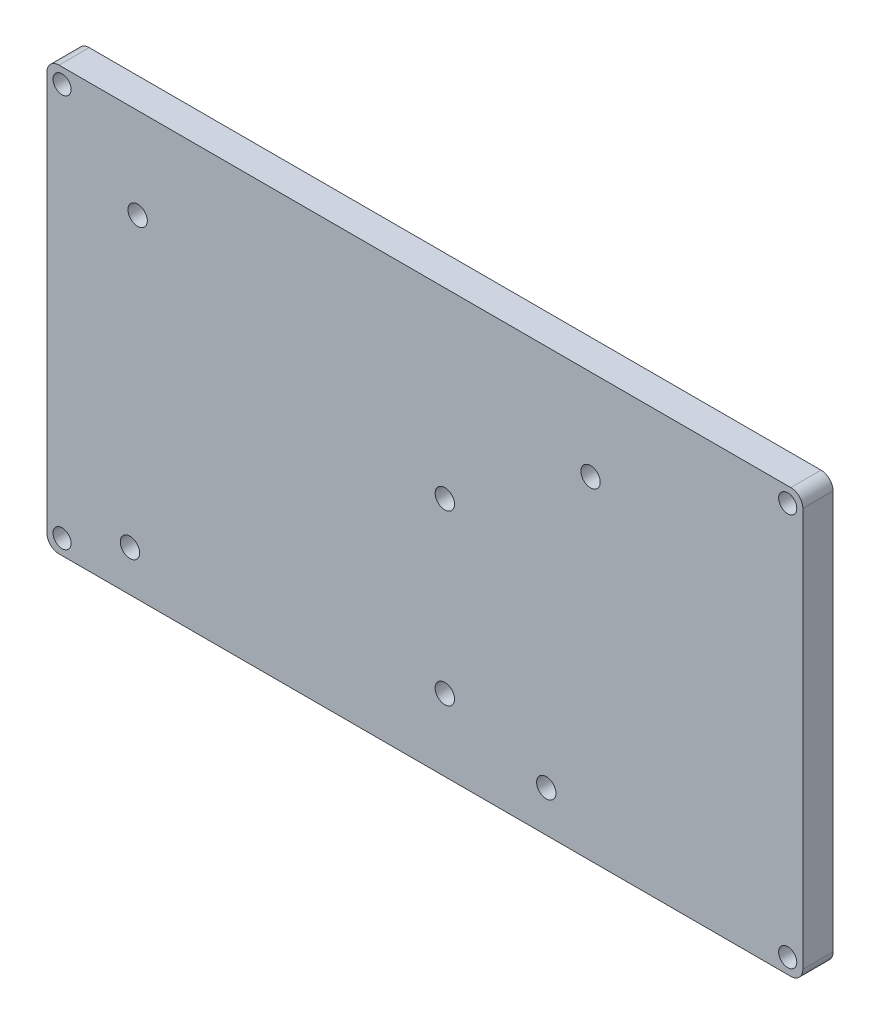
ISO-10303-21;
HEADER;
FILE_DESCRIPTION(('STEP AP214'),'2;1');
FILE_NAME('part.step','',(''),(''),'','','');
FILE_SCHEMA(('AUTOMOTIVE_DESIGN { 1 0 10303 214 1 1 1 1 }'));
ENDSEC;
DATA;
#1=APPLICATION_CONTEXT('core data for automotive mechanical design processes');
#2=APPLICATION_PROTOCOL_DEFINITION('international standard','automotive_design',2000,#1);
#3=PRODUCT_CONTEXT('',#1,'mechanical');
#4=PRODUCT('Part','Part','',(#3));
#5=PRODUCT_RELATED_PRODUCT_CATEGORY('part','',(#4));
#6=PRODUCT_DEFINITION_FORMATION('','',#4);
#7=PRODUCT_DEFINITION_CONTEXT('part definition',#1,'design');
#8=PRODUCT_DEFINITION('design','',#6,#7);
#9=PRODUCT_DEFINITION_SHAPE('','',#8);
#10=(LENGTH_UNIT() NAMED_UNIT(*) SI_UNIT(.MILLI.,.METRE.));
#11=(NAMED_UNIT(*) PLANE_ANGLE_UNIT() SI_UNIT($,.RADIAN.));
#12=(NAMED_UNIT(*) SI_UNIT($,.STERADIAN.) SOLID_ANGLE_UNIT());
#13=UNCERTAINTY_MEASURE_WITH_UNIT(LENGTH_MEASURE(1.E-05),#10,'distance_accuracy_value','');
#14=(GEOMETRIC_REPRESENTATION_CONTEXT(3) GLOBAL_UNCERTAINTY_ASSIGNED_CONTEXT((#13)) GLOBAL_UNIT_ASSIGNED_CONTEXT((#10,
#11,#12)) REPRESENTATION_CONTEXT('',''));
#15=CARTESIAN_POINT('',(0.,0.,0.));
#16=DIRECTION('',(0.,0.,1.));
#17=DIRECTION('',(1.,0.,0.));
#18=AXIS2_PLACEMENT_3D('',#15,#16,#17);
#19=CARTESIAN_POINT('',(0.,0.,5.));
#20=DIRECTION('',(0.,0.,-1.));
#21=DIRECTION('',(-1.,0.,0.));
#22=AXIS2_PLACEMENT_3D('',#19,#20,#21);
#23=PLANE('',#22);
#24=DIRECTION('',(0.,-1.,0.));
#25=VECTOR('',#24,1.);
#26=CARTESIAN_POINT('',(0.,0.,5.));
#27=LINE('',#26,#25);
#28=CARTESIAN_POINT('',(0.,68.,5.));
#29=VERTEX_POINT('',#28);
#30=CARTESIAN_POINT('',(0.,2.,5.));
#31=VERTEX_POINT('',#30);
#32=EDGE_CURVE('E151',#29,#31,#27,.T.);
#33=ORIENTED_EDGE('',*,*,#32,.T.);
#34=CARTESIAN_POINT('',(2.,2.,5.));
#35=DIRECTION('',(0.,0.,-1.));
#36=DIRECTION('',(-1.,0.,0.));
#37=AXIS2_PLACEMENT_3D('',#34,#35,#36);
#38=CIRCLE('',#37,2.);
#39=CARTESIAN_POINT('',(2.,0.,5.));
#40=VERTEX_POINT('',#39);
#41=EDGE_CURVE('E175',#31,#40,#38,.F.);
#42=ORIENTED_EDGE('',*,*,#41,.T.);
#43=DIRECTION('',(1.,0.,0.));
#44=VECTOR('',#43,1.);
#45=CARTESIAN_POINT('',(0.,0.,5.));
#46=LINE('',#45,#44);
#47=CARTESIAN_POINT('',(123.,0.,5.));
#48=VERTEX_POINT('',#47);
#49=EDGE_CURVE('E128',#40,#48,#46,.T.);
#50=ORIENTED_EDGE('',*,*,#49,.T.);
#51=CARTESIAN_POINT('',(123.,2.,5.));
#52=DIRECTION('',(0.,0.,-1.));
#53=DIRECTION('',(-1.,0.,0.));
#54=AXIS2_PLACEMENT_3D('',#51,#52,#53);
#55=CIRCLE('',#54,2.);
#56=CARTESIAN_POINT('',(125.,2.,5.));
#57=VERTEX_POINT('',#56);
#58=EDGE_CURVE('E167',#48,#57,#55,.F.);
#59=ORIENTED_EDGE('',*,*,#58,.T.);
#60=DIRECTION('',(0.,1.,0.));
#61=VECTOR('',#60,1.);
#62=CARTESIAN_POINT('',(125.,0.,5.));
#63=LINE('',#62,#61);
#64=CARTESIAN_POINT('',(125.,68.,5.));
#65=VERTEX_POINT('',#64);
#66=EDGE_CURVE('E190',#57,#65,#63,.T.);
#67=ORIENTED_EDGE('',*,*,#66,.T.);
#68=CARTESIAN_POINT('',(123.,68.,5.));
#69=DIRECTION('',(0.,0.,-1.));
#70=DIRECTION('',(-1.,0.,0.));
#71=AXIS2_PLACEMENT_3D('',#68,#69,#70);
#72=CIRCLE('',#71,2.);
#73=CARTESIAN_POINT('',(123.,70.,5.));
#74=VERTEX_POINT('',#73);
#75=EDGE_CURVE('E63',#65,#74,#72,.F.);
#76=ORIENTED_EDGE('',*,*,#75,.T.);
#77=DIRECTION('',(-1.,0.,0.));
#78=VECTOR('',#77,1.);
#79=CARTESIAN_POINT('',(0.,70.,5.));
#80=LINE('',#79,#78);
#81=CARTESIAN_POINT('',(2.,70.,5.));
#82=VERTEX_POINT('',#81);
#83=EDGE_CURVE('E153',#74,#82,#80,.T.);
#84=ORIENTED_EDGE('',*,*,#83,.T.);
#85=CARTESIAN_POINT('',(2.,68.,5.));
#86=DIRECTION('',(0.,0.,-1.));
#87=DIRECTION('',(-1.,0.,0.));
#88=AXIS2_PLACEMENT_3D('',#85,#86,#87);
#89=CIRCLE('',#88,2.);
#90=EDGE_CURVE('E172',#82,#29,#89,.F.);
#91=ORIENTED_EDGE('',*,*,#90,.T.);
#92=EDGE_LOOP('',(#33,#42,#50,#59,#67,#76,#84,#91));
#93=FACE_BOUND('',#92,.T.);
#94=CARTESIAN_POINT('',(15.,55.,5.));
#95=DIRECTION('',(0.,0.,1.));
#96=DIRECTION('',(1.,0.,0.));
#97=AXIS2_PLACEMENT_3D('',#94,#95,#96);
#98=CIRCLE('',#97,1.6);
#99=CARTESIAN_POINT('',(16.6,55.,5.));
#100=VERTEX_POINT('',#99);
#101=EDGE_CURVE('E145',#100,#100,#98,.T.);
#102=ORIENTED_EDGE('',*,*,#101,.F.);
#103=EDGE_LOOP('',(#102));
#104=FACE_BOUND('',#103,.T.);
#105=CARTESIAN_POINT('',(13.73,6.80000000000001,5.));
#106=DIRECTION('',(0.,0.,1.));
#107=DIRECTION('',(1.,0.,0.));
#108=AXIS2_PLACEMENT_3D('',#105,#106,#107);
#109=CIRCLE('',#108,1.6);
#110=CARTESIAN_POINT('',(15.33,6.80000000000001,5.));
#111=VERTEX_POINT('',#110);
#112=EDGE_CURVE('E212',#111,#111,#109,.T.);
#113=ORIENTED_EDGE('',*,*,#112,.F.);
#114=EDGE_LOOP('',(#113));
#115=FACE_BOUND('',#114,.T.);
#116=CARTESIAN_POINT('',(82.5735337569586,6.80000000000001,5.));
#117=DIRECTION('',(0.,0.,1.));
#118=DIRECTION('',(1.,0.,0.));
#119=AXIS2_PLACEMENT_3D('',#116,#117,#118);
#120=CIRCLE('',#119,1.60000000000001);
#121=CARTESIAN_POINT('',(84.1735337569586,6.80000000000001,5.));
#122=VERTEX_POINT('',#121);
#123=EDGE_CURVE('E220',#122,#122,#120,.T.);
#124=ORIENTED_EDGE('',*,*,#123,.F.);
#125=EDGE_LOOP('',(#124));
#126=FACE_BOUND('',#125,.T.);
#127=CARTESIAN_POINT('',(89.9,55.,5.));
#128=DIRECTION('',(0.,0.,1.));
#129=DIRECTION('',(1.,0.,0.));
#130=AXIS2_PLACEMENT_3D('',#127,#128,#129);
#131=CIRCLE('',#130,1.60000000000001);
#132=CARTESIAN_POINT('',(91.5,55.,5.));
#133=VERTEX_POINT('',#132);
#134=EDGE_CURVE('E228',#133,#133,#131,.T.);
#135=ORIENTED_EDGE('',*,*,#134,.F.);
#136=EDGE_LOOP('',(#135));
#137=FACE_BOUND('',#136,.T.);
#138=CARTESIAN_POINT('',(65.8,39.8,5.));
#139=DIRECTION('',(0.,0.,1.));
#140=DIRECTION('',(1.,0.,0.));
#141=AXIS2_PLACEMENT_3D('',#138,#139,#140);
#142=CIRCLE('',#141,1.60000000000001);
#143=CARTESIAN_POINT('',(67.4,39.8,5.));
#144=VERTEX_POINT('',#143);
#145=EDGE_CURVE('E236',#144,#144,#142,.T.);
#146=ORIENTED_EDGE('',*,*,#145,.F.);
#147=EDGE_LOOP('',(#146));
#148=FACE_BOUND('',#147,.T.);
#149=CARTESIAN_POINT('',(65.8,11.9,5.));
#150=DIRECTION('',(0.,0.,1.));
#151=DIRECTION('',(1.,0.,0.));
#152=AXIS2_PLACEMENT_3D('',#149,#150,#151);
#153=CIRCLE('',#152,1.6);
#154=CARTESIAN_POINT('',(67.4,11.9,5.));
#155=VERTEX_POINT('',#154);
#156=EDGE_CURVE('E244',#155,#155,#153,.T.);
#157=ORIENTED_EDGE('',*,*,#156,.F.);
#158=EDGE_LOOP('',(#157));
#159=FACE_BOUND('',#158,.T.);
#160=CARTESIAN_POINT('',(2.5,67.5,5.));
#161=DIRECTION('',(0.,0.,1.));
#162=DIRECTION('',(1.,0.,0.));
#163=AXIS2_PLACEMENT_3D('',#160,#161,#162);
#164=CIRCLE('',#163,1.5);
#165=CARTESIAN_POINT('',(4.,67.5,5.));
#166=VERTEX_POINT('',#165);
#167=EDGE_CURVE('E252',#166,#166,#164,.T.);
#168=ORIENTED_EDGE('',*,*,#167,.F.);
#169=EDGE_LOOP('',(#168));
#170=FACE_BOUND('',#169,.T.);
#171=CARTESIAN_POINT('',(122.5,2.5,5.));
#172=DIRECTION('',(0.,0.,1.));
#173=DIRECTION('',(-1.,0.,0.));
#174=AXIS2_PLACEMENT_3D('',#171,#172,#173);
#175=CIRCLE('',#174,1.5);
#176=CARTESIAN_POINT('',(121.,2.5,5.));
#177=VERTEX_POINT('',#176);
#178=EDGE_CURVE('E260',#177,#177,#175,.T.);
#179=ORIENTED_EDGE('',*,*,#178,.F.);
#180=EDGE_LOOP('',(#179));
#181=FACE_BOUND('',#180,.T.);
#182=CARTESIAN_POINT('',(122.5,67.5,5.));
#183=DIRECTION('',(0.,0.,1.));
#184=DIRECTION('',(1.,0.,0.));
#185=AXIS2_PLACEMENT_3D('',#182,#183,#184);
#186=CIRCLE('',#185,1.5);
#187=CARTESIAN_POINT('',(124.,67.5,5.));
#188=VERTEX_POINT('',#187);
#189=EDGE_CURVE('E268',#188,#188,#186,.T.);
#190=ORIENTED_EDGE('',*,*,#189,.F.);
#191=EDGE_LOOP('',(#190));
#192=FACE_BOUND('',#191,.T.);
#193=CARTESIAN_POINT('',(2.5,2.5,5.));
#194=DIRECTION('',(0.,0.,1.));
#195=DIRECTION('',(-1.,0.,0.));
#196=AXIS2_PLACEMENT_3D('',#193,#194,#195);
#197=CIRCLE('',#196,1.5);
#198=CARTESIAN_POINT('',(1.,2.5,5.));
#199=VERTEX_POINT('',#198);
#200=EDGE_CURVE('E276',#199,#199,#197,.T.);
#201=ORIENTED_EDGE('',*,*,#200,.F.);
#202=EDGE_LOOP('',(#201));
#203=FACE_BOUND('',#202,.T.);
#204=ADVANCED_FACE('F40',(#93,#104,#115,#126,#137,#148,#159,#170,#181,#192,#203),#23,.F.);
#205=CARTESIAN_POINT('',(0.,0.,0.));
#206=DIRECTION('',(0.,0.,-1.));
#207=DIRECTION('',(-1.,0.,0.));
#208=AXIS2_PLACEMENT_3D('',#205,#206,#207);
#209=PLANE('',#208);
#210=CARTESIAN_POINT('',(122.5,67.5,0.));
#211=DIRECTION('',(0.,0.,1.));
#212=DIRECTION('',(1.,0.,0.));
#213=AXIS2_PLACEMENT_3D('',#210,#211,#212);
#214=CIRCLE('',#213,1.5);
#215=CARTESIAN_POINT('',(124.,67.5,0.));
#216=VERTEX_POINT('',#215);
#217=EDGE_CURVE('E272',#216,#216,#214,.T.);
#218=ORIENTED_EDGE('',*,*,#217,.T.);
#219=EDGE_LOOP('',(#218));
#220=FACE_BOUND('',#219,.T.);
#221=CARTESIAN_POINT('',(2.5,67.5,0.));
#222=DIRECTION('',(0.,0.,1.));
#223=DIRECTION('',(1.,0.,0.));
#224=AXIS2_PLACEMENT_3D('',#221,#222,#223);
#225=CIRCLE('',#224,1.5);
#226=CARTESIAN_POINT('',(4.,67.5,0.));
#227=VERTEX_POINT('',#226);
#228=EDGE_CURVE('E256',#227,#227,#225,.T.);
#229=ORIENTED_EDGE('',*,*,#228,.T.);
#230=EDGE_LOOP('',(#229));
#231=FACE_BOUND('',#230,.T.);
#232=CARTESIAN_POINT('',(65.8,39.8,0.));
#233=DIRECTION('',(0.,0.,1.));
#234=DIRECTION('',(1.,0.,0.));
#235=AXIS2_PLACEMENT_3D('',#232,#233,#234);
#236=CIRCLE('',#235,1.60000000000001);
#237=CARTESIAN_POINT('',(67.4,39.8,0.));
#238=VERTEX_POINT('',#237);
#239=EDGE_CURVE('E240',#238,#238,#236,.T.);
#240=ORIENTED_EDGE('',*,*,#239,.T.);
#241=EDGE_LOOP('',(#240));
#242=FACE_BOUND('',#241,.T.);
#243=CARTESIAN_POINT('',(82.5735337569586,6.80000000000001,0.));
#244=DIRECTION('',(0.,0.,1.));
#245=DIRECTION('',(1.,0.,0.));
#246=AXIS2_PLACEMENT_3D('',#243,#244,#245);
#247=CIRCLE('',#246,1.60000000000001);
#248=CARTESIAN_POINT('',(84.1735337569586,6.80000000000001,0.));
#249=VERTEX_POINT('',#248);
#250=EDGE_CURVE('E224',#249,#249,#247,.T.);
#251=ORIENTED_EDGE('',*,*,#250,.T.);
#252=EDGE_LOOP('',(#251));
#253=FACE_BOUND('',#252,.T.);
#254=CARTESIAN_POINT('',(15.,55.,0.));
#255=DIRECTION('',(0.,0.,1.));
#256=DIRECTION('',(1.,0.,0.));
#257=AXIS2_PLACEMENT_3D('',#254,#255,#256);
#258=CIRCLE('',#257,1.6);
#259=CARTESIAN_POINT('',(16.6,55.,0.));
#260=VERTEX_POINT('',#259);
#261=EDGE_CURVE('E208',#260,#260,#258,.T.);
#262=ORIENTED_EDGE('',*,*,#261,.T.);
#263=EDGE_LOOP('',(#262));
#264=FACE_BOUND('',#263,.T.);
#265=DIRECTION('',(1.,0.,0.));
#266=VECTOR('',#265,1.);
#267=CARTESIAN_POINT('',(0.,0.,0.));
#268=LINE('',#267,#266);
#269=CARTESIAN_POINT('',(2.,0.,0.));
#270=VERTEX_POINT('',#269);
#271=CARTESIAN_POINT('',(123.,0.,0.));
#272=VERTEX_POINT('',#271);
#273=EDGE_CURVE('E125',#270,#272,#268,.T.);
#274=ORIENTED_EDGE('',*,*,#273,.F.);
#275=CARTESIAN_POINT('',(2.,2.,0.));
#276=DIRECTION('',(0.,0.,-1.));
#277=DIRECTION('',(-1.,0.,0.));
#278=AXIS2_PLACEMENT_3D('',#275,#276,#277);
#279=CIRCLE('',#278,2.);
#280=CARTESIAN_POINT('',(0.,2.,0.));
#281=VERTEX_POINT('',#280);
#282=EDGE_CURVE('E107',#270,#281,#279,.T.);
#283=ORIENTED_EDGE('',*,*,#282,.T.);
#284=DIRECTION('',(0.,-1.,0.));
#285=VECTOR('',#284,1.);
#286=CARTESIAN_POINT('',(0.,0.,0.));
#287=LINE('',#286,#285);
#288=CARTESIAN_POINT('',(0.,68.,0.));
#289=VERTEX_POINT('',#288);
#290=EDGE_CURVE('E138',#289,#281,#287,.T.);
#291=ORIENTED_EDGE('',*,*,#290,.F.);
#292=CARTESIAN_POINT('',(2.,68.,0.));
#293=DIRECTION('',(0.,0.,-1.));
#294=DIRECTION('',(-1.,0.,0.));
#295=AXIS2_PLACEMENT_3D('',#292,#293,#294);
#296=CIRCLE('',#295,2.);
#297=CARTESIAN_POINT('',(2.,70.,0.));
#298=VERTEX_POINT('',#297);
#299=EDGE_CURVE('E119',#289,#298,#296,.T.);
#300=ORIENTED_EDGE('',*,*,#299,.T.);
#301=DIRECTION('',(-1.,0.,0.));
#302=VECTOR('',#301,1.);
#303=CARTESIAN_POINT('',(0.,70.,0.));
#304=LINE('',#303,#302);
#305=CARTESIAN_POINT('',(123.,70.,0.));
#306=VERTEX_POINT('',#305);
#307=EDGE_CURVE('E143',#306,#298,#304,.T.);
#308=ORIENTED_EDGE('',*,*,#307,.F.);
#309=CARTESIAN_POINT('',(123.,68.,0.));
#310=DIRECTION('',(0.,0.,-1.));
#311=DIRECTION('',(-1.,0.,0.));
#312=AXIS2_PLACEMENT_3D('',#309,#310,#311);
#313=CIRCLE('',#312,2.);
#314=CARTESIAN_POINT('',(125.,68.,0.));
#315=VERTEX_POINT('',#314);
#316=EDGE_CURVE('E157',#306,#315,#313,.T.);
#317=ORIENTED_EDGE('',*,*,#316,.T.);
#318=DIRECTION('',(0.,1.,0.));
#319=VECTOR('',#318,1.);
#320=CARTESIAN_POINT('',(125.,0.,0.));
#321=LINE('',#320,#319);
#322=CARTESIAN_POINT('',(125.,2.,0.));
#323=VERTEX_POINT('',#322);
#324=EDGE_CURVE('E137',#323,#315,#321,.T.);
#325=ORIENTED_EDGE('',*,*,#324,.F.);
#326=CARTESIAN_POINT('',(123.,2.,0.));
#327=DIRECTION('',(0.,0.,-1.));
#328=DIRECTION('',(-1.,0.,0.));
#329=AXIS2_PLACEMENT_3D('',#326,#327,#328);
#330=CIRCLE('',#329,2.);
#331=EDGE_CURVE('E130',#323,#272,#330,.T.);
#332=ORIENTED_EDGE('',*,*,#331,.T.);
#333=EDGE_LOOP('',(#274,#283,#291,#300,#308,#317,#325,#332));
#334=FACE_BOUND('',#333,.T.);
#335=CARTESIAN_POINT('',(13.73,6.80000000000001,0.));
#336=DIRECTION('',(0.,0.,1.));
#337=DIRECTION('',(1.,0.,0.));
#338=AXIS2_PLACEMENT_3D('',#335,#336,#337);
#339=CIRCLE('',#338,1.6);
#340=CARTESIAN_POINT('',(15.33,6.80000000000001,0.));
#341=VERTEX_POINT('',#340);
#342=EDGE_CURVE('E216',#341,#341,#339,.T.);
#343=ORIENTED_EDGE('',*,*,#342,.T.);
#344=EDGE_LOOP('',(#343));
#345=FACE_BOUND('',#344,.T.);
#346=CARTESIAN_POINT('',(89.9,55.,0.));
#347=DIRECTION('',(0.,0.,1.));
#348=DIRECTION('',(1.,0.,0.));
#349=AXIS2_PLACEMENT_3D('',#346,#347,#348);
#350=CIRCLE('',#349,1.60000000000001);
#351=CARTESIAN_POINT('',(91.5,55.,0.));
#352=VERTEX_POINT('',#351);
#353=EDGE_CURVE('E232',#352,#352,#350,.T.);
#354=ORIENTED_EDGE('',*,*,#353,.T.);
#355=EDGE_LOOP('',(#354));
#356=FACE_BOUND('',#355,.T.);
#357=CARTESIAN_POINT('',(65.8,11.9,0.));
#358=DIRECTION('',(0.,0.,1.));
#359=DIRECTION('',(1.,0.,0.));
#360=AXIS2_PLACEMENT_3D('',#357,#358,#359);
#361=CIRCLE('',#360,1.6);
#362=CARTESIAN_POINT('',(67.4,11.9,0.));
#363=VERTEX_POINT('',#362);
#364=EDGE_CURVE('E248',#363,#363,#361,.T.);
#365=ORIENTED_EDGE('',*,*,#364,.T.);
#366=EDGE_LOOP('',(#365));
#367=FACE_BOUND('',#366,.T.);
#368=CARTESIAN_POINT('',(122.5,2.5,0.));
#369=DIRECTION('',(0.,0.,1.));
#370=DIRECTION('',(-1.,0.,0.));
#371=AXIS2_PLACEMENT_3D('',#368,#369,#370);
#372=CIRCLE('',#371,1.5);
#373=CARTESIAN_POINT('',(121.,2.5,0.));
#374=VERTEX_POINT('',#373);
#375=EDGE_CURVE('E264',#374,#374,#372,.T.);
#376=ORIENTED_EDGE('',*,*,#375,.T.);
#377=EDGE_LOOP('',(#376));
#378=FACE_BOUND('',#377,.T.);
#379=CARTESIAN_POINT('',(2.5,2.5,0.));
#380=DIRECTION('',(0.,0.,1.));
#381=DIRECTION('',(-1.,0.,0.));
#382=AXIS2_PLACEMENT_3D('',#379,#380,#381);
#383=CIRCLE('',#382,1.5);
#384=CARTESIAN_POINT('',(1.,2.5,0.));
#385=VERTEX_POINT('',#384);
#386=EDGE_CURVE('E280',#385,#385,#383,.T.);
#387=ORIENTED_EDGE('',*,*,#386,.T.);
#388=EDGE_LOOP('',(#387));
#389=FACE_BOUND('',#388,.T.);
#390=ADVANCED_FACE('F133',(#220,#231,#242,#253,#264,#334,#345,#356,#367,#378,#389),#209,.T.);
#391=CARTESIAN_POINT('',(0.,0.,5.));
#392=DIRECTION('',(1.,0.,0.));
#393=DIRECTION('',(0.,0.,-1.));
#394=AXIS2_PLACEMENT_3D('',#391,#392,#393);
#395=PLANE('',#394);
#396=ORIENTED_EDGE('',*,*,#290,.T.);
#397=DIRECTION('',(0.,0.,-1.));
#398=VECTOR('',#397,1.);
#399=CARTESIAN_POINT('',(0.,2.,5.));
#400=LINE('',#399,#398);
#401=EDGE_CURVE('E112',#281,#31,#400,.F.);
#402=ORIENTED_EDGE('',*,*,#401,.T.);
#403=ORIENTED_EDGE('',*,*,#32,.F.);
#404=DIRECTION('',(0.,0.,-1.));
#405=VECTOR('',#404,1.);
#406=CARTESIAN_POINT('',(0.,68.,5.));
#407=LINE('',#406,#405);
#408=EDGE_CURVE('E118',#29,#289,#407,.T.);
#409=ORIENTED_EDGE('',*,*,#408,.T.);
#410=EDGE_LOOP('',(#396,#402,#403,#409));
#411=FACE_BOUND('',#410,.T.);
#412=ADVANCED_FACE('F295',(#411),#395,.F.);
#413=CARTESIAN_POINT('',(0.,0.,5.));
#414=DIRECTION('',(0.,1.,0.));
#415=DIRECTION('',(0.,0.,1.));
#416=AXIS2_PLACEMENT_3D('',#413,#414,#415);
#417=PLANE('',#416);
#418=ORIENTED_EDGE('',*,*,#49,.F.);
#419=DIRECTION('',(0.,0.,-1.));
#420=VECTOR('',#419,1.);
#421=CARTESIAN_POINT('',(2.,0.,5.));
#422=LINE('',#421,#420);
#423=EDGE_CURVE('E111',#40,#270,#422,.T.);
#424=ORIENTED_EDGE('',*,*,#423,.T.);
#425=ORIENTED_EDGE('',*,*,#273,.T.);
#426=DIRECTION('',(0.,0.,-1.));
#427=VECTOR('',#426,1.);
#428=CARTESIAN_POINT('',(123.,0.,5.));
#429=LINE('',#428,#427);
#430=EDGE_CURVE('E131',#272,#48,#429,.F.);
#431=ORIENTED_EDGE('',*,*,#430,.T.);
#432=EDGE_LOOP('',(#418,#424,#425,#431));
#433=FACE_BOUND('',#432,.T.);
#434=ADVANCED_FACE('F124',(#433),#417,.F.);
#435=CARTESIAN_POINT('',(125.,0.,5.));
#436=DIRECTION('',(-1.,0.,0.));
#437=DIRECTION('',(0.,0.,1.));
#438=AXIS2_PLACEMENT_3D('',#435,#436,#437);
#439=PLANE('',#438);
#440=ORIENTED_EDGE('',*,*,#324,.T.);
#441=DIRECTION('',(0.,0.,-1.));
#442=VECTOR('',#441,1.);
#443=CARTESIAN_POINT('',(125.,68.,5.));
#444=LINE('',#443,#442);
#445=EDGE_CURVE('E11',#315,#65,#444,.F.);
#446=ORIENTED_EDGE('',*,*,#445,.T.);
#447=ORIENTED_EDGE('',*,*,#66,.F.);
#448=DIRECTION('',(0.,0.,-1.));
#449=VECTOR('',#448,1.);
#450=CARTESIAN_POINT('',(125.,2.,5.));
#451=LINE('',#450,#449);
#452=EDGE_CURVE('E49',#57,#323,#451,.T.);
#453=ORIENTED_EDGE('',*,*,#452,.T.);
#454=EDGE_LOOP('',(#440,#446,#447,#453));
#455=FACE_BOUND('',#454,.T.);
#456=ADVANCED_FACE('F188',(#455),#439,.F.);
#457=CARTESIAN_POINT('',(0.,70.,5.));
#458=DIRECTION('',(0.,-1.,0.));
#459=DIRECTION('',(0.,0.,-1.));
#460=AXIS2_PLACEMENT_3D('',#457,#458,#459);
#461=PLANE('',#460);
#462=ORIENTED_EDGE('',*,*,#307,.T.);
#463=DIRECTION('',(0.,0.,-1.));
#464=VECTOR('',#463,1.);
#465=CARTESIAN_POINT('',(2.,70.,5.));
#466=LINE('',#465,#464);
#467=EDGE_CURVE('E56',#298,#82,#466,.F.);
#468=ORIENTED_EDGE('',*,*,#467,.T.);
#469=ORIENTED_EDGE('',*,*,#83,.F.);
#470=DIRECTION('',(0.,0.,-1.));
#471=VECTOR('',#470,1.);
#472=CARTESIAN_POINT('',(123.,70.,5.));
#473=LINE('',#472,#471);
#474=EDGE_CURVE('E178',#74,#306,#473,.T.);
#475=ORIENTED_EDGE('',*,*,#474,.T.);
#476=EDGE_LOOP('',(#462,#468,#469,#475));
#477=FACE_BOUND('',#476,.T.);
#478=ADVANCED_FACE('F197',(#477),#461,.F.);
#479=CARTESIAN_POINT('',(15.,55.,5.));
#480=DIRECTION('',(0.,0.,-1.));
#481=DIRECTION('',(-1.,0.,0.));
#482=AXIS2_PLACEMENT_3D('',#479,#480,#481);
#483=CYLINDRICAL_SURFACE('',#482,1.6);
#484=ORIENTED_EDGE('',*,*,#101,.T.);
#485=EDGE_LOOP('',(#484));
#486=FACE_BOUND('',#485,.T.);
#487=ORIENTED_EDGE('',*,*,#261,.F.);
#488=EDGE_LOOP('',(#487));
#489=FACE_BOUND('',#488,.T.);
#490=ADVANCED_FACE('F300',(#486,#489),#483,.F.);
#491=CARTESIAN_POINT('',(13.73,6.80000000000001,5.));
#492=DIRECTION('',(0.,0.,-1.));
#493=DIRECTION('',(-1.,0.,0.));
#494=AXIS2_PLACEMENT_3D('',#491,#492,#493);
#495=CYLINDRICAL_SURFACE('',#494,1.6);
#496=ORIENTED_EDGE('',*,*,#112,.T.);
#497=EDGE_LOOP('',(#496));
#498=FACE_BOUND('',#497,.T.);
#499=ORIENTED_EDGE('',*,*,#342,.F.);
#500=EDGE_LOOP('',(#499));
#501=FACE_BOUND('',#500,.T.);
#502=ADVANCED_FACE('F445',(#498,#501),#495,.F.);
#503=CARTESIAN_POINT('',(82.5735337569586,6.80000000000001,5.));
#504=DIRECTION('',(0.,0.,-1.));
#505=DIRECTION('',(-1.,0.,0.));
#506=AXIS2_PLACEMENT_3D('',#503,#504,#505);
#507=CYLINDRICAL_SURFACE('',#506,1.60000000000001);
#508=ORIENTED_EDGE('',*,*,#123,.T.);
#509=EDGE_LOOP('',(#508));
#510=FACE_BOUND('',#509,.T.);
#511=ORIENTED_EDGE('',*,*,#250,.F.);
#512=EDGE_LOOP('',(#511));
#513=FACE_BOUND('',#512,.T.);
#514=ADVANCED_FACE('F435',(#510,#513),#507,.F.);
#515=CARTESIAN_POINT('',(89.9,55.,5.));
#516=DIRECTION('',(0.,0.,-1.));
#517=DIRECTION('',(-1.,0.,0.));
#518=AXIS2_PLACEMENT_3D('',#515,#516,#517);
#519=CYLINDRICAL_SURFACE('',#518,1.60000000000001);
#520=ORIENTED_EDGE('',*,*,#134,.T.);
#521=EDGE_LOOP('',(#520));
#522=FACE_BOUND('',#521,.T.);
#523=ORIENTED_EDGE('',*,*,#353,.F.);
#524=EDGE_LOOP('',(#523));
#525=FACE_BOUND('',#524,.T.);
#526=ADVANCED_FACE('F425',(#522,#525),#519,.F.);
#527=CARTESIAN_POINT('',(65.8,39.8,5.));
#528=DIRECTION('',(0.,0.,-1.));
#529=DIRECTION('',(-1.,0.,0.));
#530=AXIS2_PLACEMENT_3D('',#527,#528,#529);
#531=CYLINDRICAL_SURFACE('',#530,1.60000000000001);
#532=ORIENTED_EDGE('',*,*,#145,.T.);
#533=EDGE_LOOP('',(#532));
#534=FACE_BOUND('',#533,.T.);
#535=ORIENTED_EDGE('',*,*,#239,.F.);
#536=EDGE_LOOP('',(#535));
#537=FACE_BOUND('',#536,.T.);
#538=ADVANCED_FACE('F415',(#534,#537),#531,.F.);
#539=CARTESIAN_POINT('',(65.8,11.9,5.));
#540=DIRECTION('',(0.,0.,-1.));
#541=DIRECTION('',(-1.,0.,0.));
#542=AXIS2_PLACEMENT_3D('',#539,#540,#541);
#543=CYLINDRICAL_SURFACE('',#542,1.6);
#544=ORIENTED_EDGE('',*,*,#156,.T.);
#545=EDGE_LOOP('',(#544));
#546=FACE_BOUND('',#545,.T.);
#547=ORIENTED_EDGE('',*,*,#364,.F.);
#548=EDGE_LOOP('',(#547));
#549=FACE_BOUND('',#548,.T.);
#550=ADVANCED_FACE('F405',(#546,#549),#543,.F.);
#551=CARTESIAN_POINT('',(2.5,67.5,5.));
#552=DIRECTION('',(0.,0.,-1.));
#553=DIRECTION('',(-1.,0.,0.));
#554=AXIS2_PLACEMENT_3D('',#551,#552,#553);
#555=CYLINDRICAL_SURFACE('',#554,1.5);
#556=ORIENTED_EDGE('',*,*,#167,.T.);
#557=EDGE_LOOP('',(#556));
#558=FACE_BOUND('',#557,.T.);
#559=ORIENTED_EDGE('',*,*,#228,.F.);
#560=EDGE_LOOP('',(#559));
#561=FACE_BOUND('',#560,.T.);
#562=ADVANCED_FACE('F395',(#558,#561),#555,.F.);
#563=CARTESIAN_POINT('',(122.5,2.5,5.));
#564=DIRECTION('',(0.,0.,-1.));
#565=DIRECTION('',(-1.,0.,0.));
#566=AXIS2_PLACEMENT_3D('',#563,#564,#565);
#567=CYLINDRICAL_SURFACE('',#566,1.5);
#568=ORIENTED_EDGE('',*,*,#178,.T.);
#569=EDGE_LOOP('',(#568));
#570=FACE_BOUND('',#569,.T.);
#571=ORIENTED_EDGE('',*,*,#375,.F.);
#572=EDGE_LOOP('',(#571));
#573=FACE_BOUND('',#572,.T.);
#574=ADVANCED_FACE('F385',(#570,#573),#567,.F.);
#575=CARTESIAN_POINT('',(122.5,67.5,5.));
#576=DIRECTION('',(0.,0.,-1.));
#577=DIRECTION('',(-1.,0.,0.));
#578=AXIS2_PLACEMENT_3D('',#575,#576,#577);
#579=CYLINDRICAL_SURFACE('',#578,1.5);
#580=ORIENTED_EDGE('',*,*,#189,.T.);
#581=EDGE_LOOP('',(#580));
#582=FACE_BOUND('',#581,.T.);
#583=ORIENTED_EDGE('',*,*,#217,.F.);
#584=EDGE_LOOP('',(#583));
#585=FACE_BOUND('',#584,.T.);
#586=ADVANCED_FACE('F376',(#582,#585),#579,.F.);
#587=CARTESIAN_POINT('',(2.5,2.5,5.));
#588=DIRECTION('',(0.,0.,-1.));
#589=DIRECTION('',(-1.,0.,0.));
#590=AXIS2_PLACEMENT_3D('',#587,#588,#589);
#591=CYLINDRICAL_SURFACE('',#590,1.5);
#592=ORIENTED_EDGE('',*,*,#200,.T.);
#593=EDGE_LOOP('',(#592));
#594=FACE_BOUND('',#593,.T.);
#595=ORIENTED_EDGE('',*,*,#386,.F.);
#596=EDGE_LOOP('',(#595));
#597=FACE_BOUND('',#596,.T.);
#598=ADVANCED_FACE('F288',(#594,#597),#591,.F.);
#599=CARTESIAN_POINT('',(2.,2.,5.));
#600=DIRECTION('',(0.,0.,-1.));
#601=DIRECTION('',(-1.,0.,0.));
#602=AXIS2_PLACEMENT_3D('',#599,#600,#601);
#603=CYLINDRICAL_SURFACE('',#602,2.);
#604=ORIENTED_EDGE('',*,*,#41,.F.);
#605=ORIENTED_EDGE('',*,*,#401,.F.);
#606=ORIENTED_EDGE('',*,*,#282,.F.);
#607=ORIENTED_EDGE('',*,*,#423,.F.);
#608=EDGE_LOOP('',(#604,#605,#606,#607));
#609=FACE_BOUND('',#608,.T.);
#610=ADVANCED_FACE('F110',(#609),#603,.T.);
#611=CARTESIAN_POINT('',(2.,68.,5.));
#612=DIRECTION('',(0.,0.,-1.));
#613=DIRECTION('',(-1.,0.,0.));
#614=AXIS2_PLACEMENT_3D('',#611,#612,#613);
#615=CYLINDRICAL_SURFACE('',#614,2.);
#616=ORIENTED_EDGE('',*,*,#90,.F.);
#617=ORIENTED_EDGE('',*,*,#467,.F.);
#618=ORIENTED_EDGE('',*,*,#299,.F.);
#619=ORIENTED_EDGE('',*,*,#408,.F.);
#620=EDGE_LOOP('',(#616,#617,#618,#619));
#621=FACE_BOUND('',#620,.T.);
#622=ADVANCED_FACE('F314',(#621),#615,.T.);
#623=CARTESIAN_POINT('',(123.,68.,5.));
#624=DIRECTION('',(0.,0.,-1.));
#625=DIRECTION('',(-1.,0.,0.));
#626=AXIS2_PLACEMENT_3D('',#623,#624,#625);
#627=CYLINDRICAL_SURFACE('',#626,2.);
#628=ORIENTED_EDGE('',*,*,#75,.F.);
#629=ORIENTED_EDGE('',*,*,#445,.F.);
#630=ORIENTED_EDGE('',*,*,#316,.F.);
#631=ORIENTED_EDGE('',*,*,#474,.F.);
#632=EDGE_LOOP('',(#628,#629,#630,#631));
#633=FACE_BOUND('',#632,.T.);
#634=ADVANCED_FACE('F196',(#633),#627,.T.);
#635=CARTESIAN_POINT('',(123.,2.,5.));
#636=DIRECTION('',(0.,0.,-1.));
#637=DIRECTION('',(-1.,0.,0.));
#638=AXIS2_PLACEMENT_3D('',#635,#636,#637);
#639=CYLINDRICAL_SURFACE('',#638,2.);
#640=ORIENTED_EDGE('',*,*,#58,.F.);
#641=ORIENTED_EDGE('',*,*,#430,.F.);
#642=ORIENTED_EDGE('',*,*,#331,.F.);
#643=ORIENTED_EDGE('',*,*,#452,.F.);
#644=EDGE_LOOP('',(#640,#641,#642,#643));
#645=FACE_BOUND('',#644,.T.);
#646=ADVANCED_FACE('F42',(#645),#639,.T.);
#647=CLOSED_SHELL('',(#204,#390,#412,#434,#456,#478,#490,#502,#514,#526,#538,#550,#562,#574,
#586,#598,#610,#622,#634,#646));
#648=MANIFOLD_SOLID_BREP('B2',#647);
#649=ADVANCED_BREP_SHAPE_REPRESENTATION('',(#18,#648),#14);
#650=SHAPE_DEFINITION_REPRESENTATION(#9,#649);
ENDSEC;
END-ISO-10303-21;
